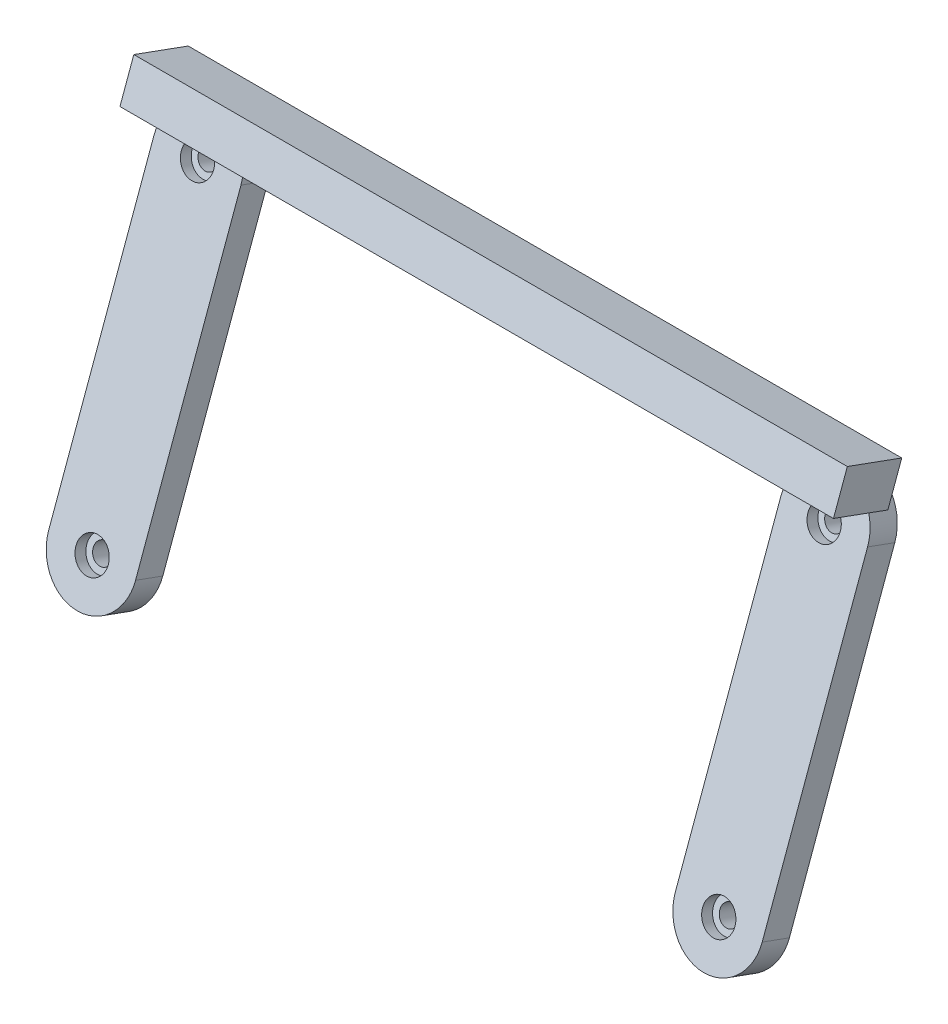
ISO-10303-21;
HEADER;
FILE_DESCRIPTION(('STEP AP214'),'2;1');
FILE_NAME('part.step','',(''),(''),'','','');
FILE_SCHEMA(('AUTOMOTIVE_DESIGN { 1 0 10303 214 1 1 1 1 }'));
ENDSEC;
DATA;
#1=APPLICATION_CONTEXT('core data for automotive mechanical design processes');
#2=APPLICATION_PROTOCOL_DEFINITION('international standard','automotive_design',2000,#1);
#3=PRODUCT_CONTEXT('',#1,'mechanical');
#4=PRODUCT('Part','Part','',(#3));
#5=PRODUCT_RELATED_PRODUCT_CATEGORY('part','',(#4));
#6=PRODUCT_DEFINITION_FORMATION('','',#4);
#7=PRODUCT_DEFINITION_CONTEXT('part definition',#1,'design');
#8=PRODUCT_DEFINITION('design','',#6,#7);
#9=PRODUCT_DEFINITION_SHAPE('','',#8);
#10=(LENGTH_UNIT() NAMED_UNIT(*) SI_UNIT(.MILLI.,.METRE.));
#11=(NAMED_UNIT(*) PLANE_ANGLE_UNIT() SI_UNIT($,.RADIAN.));
#12=(NAMED_UNIT(*) SI_UNIT($,.STERADIAN.) SOLID_ANGLE_UNIT());
#13=UNCERTAINTY_MEASURE_WITH_UNIT(LENGTH_MEASURE(1.E-05),#10,'distance_accuracy_value','');
#14=(GEOMETRIC_REPRESENTATION_CONTEXT(3) GLOBAL_UNCERTAINTY_ASSIGNED_CONTEXT((#13)) GLOBAL_UNIT_ASSIGNED_CONTEXT((#10,
#11,#12)) REPRESENTATION_CONTEXT('',''));
#15=CARTESIAN_POINT('',(0.,0.,0.));
#16=DIRECTION('',(0.,0.,1.));
#17=DIRECTION('',(1.,0.,0.));
#18=AXIS2_PLACEMENT_3D('',#15,#16,#17);
#19=CARTESIAN_POINT('',(54.1,32.8795650948428,-1.32540528538168));
#20=DIRECTION('',(0.,-0.939692620785908,0.342020143325669));
#21=DIRECTION('',(0.,-0.342020143325669,-0.939692620785908));
#22=AXIS2_PLACEMENT_3D('',#19,#20,#21);
#23=PLANE('',#22);
#24=DIRECTION('',(-1.,0.,0.));
#25=VECTOR('',#24,1.);
#26=CARTESIAN_POINT('',(54.1,29.4593636615861,-10.7223314932408));
#27=LINE('',#26,#25);
#28=CARTESIAN_POINT('',(48.2959066168327,29.4593636615861,-10.7223314932408));
#29=VERTEX_POINT('',#28);
#30=CARTESIAN_POINT('',(-48.2959066168326,29.4593636615861,-10.7223314932408));
#31=VERTEX_POINT('',#30);
#32=EDGE_CURVE('E63',#29,#31,#27,.T.);
#33=ORIENTED_EDGE('',*,*,#32,.F.);
#34=DIRECTION('',(0.,-0.342020143325669,-0.939692620785908));
#35=VECTOR('',#34,1.);
#36=CARTESIAN_POINT('',(48.2959066168327,30.1434039482374,-8.84294625166895));
#37=LINE('',#36,#35);
#38=CARTESIAN_POINT('',(48.2959066168327,30.1434039482374,-8.84294625166895));
#39=VERTEX_POINT('',#38);
#40=EDGE_CURVE('E56',#29,#39,#37,.F.);
#41=ORIENTED_EDGE('',*,*,#40,.T.);
#42=DIRECTION('',(-1.,0.,0.));
#43=VECTOR('',#42,1.);
#44=CARTESIAN_POINT('',(54.1,30.1434039482374,-8.84294625166895));
#45=LINE('',#44,#43);
#46=CARTESIAN_POINT('',(59.9040933831674,30.1434039482374,-8.84294625166895));
#47=VERTEX_POINT('',#46);
#48=EDGE_CURVE('E11',#47,#39,#45,.T.);
#49=ORIENTED_EDGE('',*,*,#48,.F.);
#50=DIRECTION('',(0.,-0.342020143325669,-0.939692620785908));
#51=VECTOR('',#50,1.);
#52=CARTESIAN_POINT('',(59.9040933831674,30.1434039482374,-8.84294625166895));
#53=LINE('',#52,#51);
#54=CARTESIAN_POINT('',(59.9040933831674,29.4593636615861,-10.7223314932408));
#55=VERTEX_POINT('',#54);
#56=EDGE_CURVE('E221',#47,#55,#53,.T.);
#57=ORIENTED_EDGE('',*,*,#56,.T.);
#58=CARTESIAN_POINT('',(61.6,29.4593636615861,-10.7223314932408));
#59=VERTEX_POINT('',#58);
#60=EDGE_CURVE('E242',#59,#55,#27,.T.);
#61=ORIENTED_EDGE('',*,*,#60,.F.);
#62=DIRECTION('',(0.,-0.342020143325669,-0.939692620785908));
#63=VECTOR('',#62,1.);
#64=CARTESIAN_POINT('',(61.6,32.8795650948428,-1.32540528538168));
#65=LINE('',#64,#63);
#66=CARTESIAN_POINT('',(61.6,32.8795650948428,-1.32540528538168));
#67=VERTEX_POINT('',#66);
#68=EDGE_CURVE('E253',#67,#59,#65,.T.);
#69=ORIENTED_EDGE('',*,*,#68,.F.);
#70=DIRECTION('',(-1.,0.,0.));
#71=VECTOR('',#70,1.);
#72=CARTESIAN_POINT('',(54.1,32.8795650948428,-1.32540528538168));
#73=LINE('',#72,#71);
#74=CARTESIAN_POINT('',(-61.6,32.8795650948428,-1.32540528538168));
#75=VERTEX_POINT('',#74);
#76=EDGE_CURVE('E228',#67,#75,#73,.T.);
#77=ORIENTED_EDGE('',*,*,#76,.T.);
#78=DIRECTION('',(0.,-0.342020143325669,-0.939692620785908));
#79=VECTOR('',#78,1.);
#80=CARTESIAN_POINT('',(-61.6,32.8795650948428,-1.32540528538168));
#81=LINE('',#80,#79);
#82=CARTESIAN_POINT('',(-61.6,29.4593636615861,-10.7223314932408));
#83=VERTEX_POINT('',#82);
#84=EDGE_CURVE('E241',#75,#83,#81,.T.);
#85=ORIENTED_EDGE('',*,*,#84,.T.);
#86=CARTESIAN_POINT('',(-59.9040933831673,29.4593636615861,-10.7223314932408));
#87=VERTEX_POINT('',#86);
#88=EDGE_CURVE('E227',#87,#83,#27,.T.);
#89=ORIENTED_EDGE('',*,*,#88,.F.);
#90=DIRECTION('',(0.,-0.342020143325669,-0.939692620785908));
#91=VECTOR('',#90,1.);
#92=CARTESIAN_POINT('',(-59.9040933831673,30.1434039482374,-8.84294625166895));
#93=LINE('',#92,#91);
#94=CARTESIAN_POINT('',(-59.9040933831673,30.1434039482374,-8.84294625166895));
#95=VERTEX_POINT('',#94);
#96=EDGE_CURVE('E327',#95,#87,#93,.T.);
#97=ORIENTED_EDGE('',*,*,#96,.F.);
#98=DIRECTION('',(1.,0.,0.));
#99=VECTOR('',#98,1.);
#100=CARTESIAN_POINT('',(-54.1,30.1434039482374,-8.84294625166895));
#101=LINE('',#100,#99);
#102=CARTESIAN_POINT('',(-48.2959066168326,30.1434039482374,-8.84294625166895));
#103=VERTEX_POINT('',#102);
#104=EDGE_CURVE('E255',#95,#103,#101,.T.);
#105=ORIENTED_EDGE('',*,*,#104,.T.);
#106=DIRECTION('',(0.,-0.342020143325669,-0.939692620785908));
#107=VECTOR('',#106,1.);
#108=CARTESIAN_POINT('',(-48.2959066168326,30.1434039482374,-8.84294625166895));
#109=LINE('',#108,#107);
#110=EDGE_CURVE('E324',#31,#103,#109,.F.);
#111=ORIENTED_EDGE('',*,*,#110,.F.);
#112=EDGE_LOOP('',(#33,#41,#49,#57,#61,#69,#77,#85,#89,#97,#105,#111));
#113=FACE_BOUND('',#112,.T.);
#114=ADVANCED_FACE('F41',(#113),#23,.T.);
#115=CARTESIAN_POINT('',(-54.1,25.6798639995565,-7.21835057089099));
#116=DIRECTION('',(0.,0.342020143325669,0.939692620785908));
#117=DIRECTION('',(0.,-0.939692620785908,0.342020143325669));
#118=AXIS2_PLACEMENT_3D('',#115,#116,#117);
#119=PLANE('',#118);
#120=ORIENTED_EDGE('',*,*,#104,.F.);
#121=CARTESIAN_POINT('',(-54.1,25.6798639995565,-7.21835057089099));
#122=DIRECTION('',(0.,0.342020143325669,0.939692620785908));
#123=DIRECTION('',(0.,-0.939692620785908,0.342020143325669));
#124=AXIS2_PLACEMENT_3D('',#121,#122,#123);
#125=CIRCLE('',#124,7.5);
#126=CARTESIAN_POINT('',(-61.6,25.6798639995565,-7.218350570891));
#127=VERTEX_POINT('',#126);
#128=EDGE_CURVE('E315',#95,#127,#125,.T.);
#129=ORIENTED_EDGE('',*,*,#128,.T.);
#130=DIRECTION('',(0.,0.939692620785908,-0.342020143325669));
#131=VECTOR('',#130,1.);
#132=CARTESIAN_POINT('',(-61.6,25.6798639995565,-7.218350570891));
#133=LINE('',#132,#131);
#134=CARTESIAN_POINT('',(-61.6,-24.3117834262538,10.9771210540346));
#135=VERTEX_POINT('',#134);
#136=EDGE_CURVE('E291',#135,#127,#133,.T.);
#137=ORIENTED_EDGE('',*,*,#136,.F.);
#138=CARTESIAN_POINT('',(-54.1,-24.3117834262538,10.9771210540346));
#139=DIRECTION('',(0.,0.342020143325669,0.939692620785908));
#140=DIRECTION('',(0.,-0.939692620785908,0.342020143325669));
#141=AXIS2_PLACEMENT_3D('',#138,#139,#140);
#142=CIRCLE('',#141,7.5);
#143=CARTESIAN_POINT('',(-46.6,-24.3117834262538,10.9771210540346));
#144=VERTEX_POINT('',#143);
#145=EDGE_CURVE('E270',#135,#144,#142,.T.);
#146=ORIENTED_EDGE('',*,*,#145,.T.);
#147=DIRECTION('',(0.,-0.939692620785908,0.342020143325669));
#148=VECTOR('',#147,1.);
#149=CARTESIAN_POINT('',(-46.6,-24.3117834262538,10.9771210540346));
#150=LINE('',#149,#148);
#151=CARTESIAN_POINT('',(-46.6,25.6798639995565,-7.218350570891));
#152=VERTEX_POINT('',#151);
#153=EDGE_CURVE('E287',#152,#144,#150,.T.);
#154=ORIENTED_EDGE('',*,*,#153,.F.);
#155=EDGE_CURVE('E318',#152,#103,#125,.T.);
#156=ORIENTED_EDGE('',*,*,#155,.T.);
#157=EDGE_LOOP('',(#120,#129,#137,#146,#154,#156));
#158=FACE_BOUND('',#157,.T.);
#159=CARTESIAN_POINT('',(-54.1,25.6798639995565,-7.21835057089099));
#160=DIRECTION('',(0.,0.342020143325669,0.939692620785908));
#161=DIRECTION('',(0.,-0.939692620785908,0.342020143325669));
#162=AXIS2_PLACEMENT_3D('',#159,#160,#161);
#163=CIRCLE('',#162,2.8);
#164=CARTESIAN_POINT('',(-54.1,23.048724661356,-6.26069416957912));
#165=VERTEX_POINT('',#164);
#166=EDGE_CURVE('E312',#165,#165,#163,.T.);
#167=ORIENTED_EDGE('',*,*,#166,.F.);
#168=EDGE_LOOP('',(#167));
#169=FACE_BOUND('',#168,.T.);
#170=CARTESIAN_POINT('',(-54.1,-24.3117834262538,10.9771210540346));
#171=DIRECTION('',(0.,0.342020143325669,0.939692620785908));
#172=DIRECTION('',(0.,-0.939692620785908,0.342020143325669));
#173=AXIS2_PLACEMENT_3D('',#170,#171,#172);
#174=CIRCLE('',#173,2.8);
#175=CARTESIAN_POINT('',(-54.1,-26.9429227644544,11.9347774553465));
#176=VERTEX_POINT('',#175);
#177=EDGE_CURVE('E275',#176,#176,#174,.T.);
#178=ORIENTED_EDGE('',*,*,#177,.F.);
#179=EDGE_LOOP('',(#178));
#180=FACE_BOUND('',#179,.T.);
#181=ADVANCED_FACE('F366',(#158,#169,#180),#119,.T.);
#182=CARTESIAN_POINT('',(-54.1,25.6798639995565,-7.21835057089099));
#183=DIRECTION('',(0.,-0.342020143325669,-0.939692620785908));
#184=DIRECTION('',(0.,0.939692620785908,-0.342020143325669));
#185=AXIS2_PLACEMENT_3D('',#182,#183,#184);
#186=CYLINDRICAL_SURFACE('',#185,7.5);
#187=ORIENTED_EDGE('',*,*,#128,.F.);
#188=ORIENTED_EDGE('',*,*,#96,.T.);
#189=CARTESIAN_POINT('',(-54.1,24.9958237129052,-9.09773581246281));
#190=DIRECTION('',(0.,-0.342020143325669,-0.939692620785908));
#191=DIRECTION('',(0.,0.939692620785908,-0.342020143325669));
#192=AXIS2_PLACEMENT_3D('',#189,#190,#191);
#193=CIRCLE('',#192,7.5);
#194=EDGE_CURVE('E321',#87,#31,#193,.T.);
#195=ORIENTED_EDGE('',*,*,#194,.T.);
#196=ORIENTED_EDGE('',*,*,#110,.T.);
#197=ORIENTED_EDGE('',*,*,#155,.F.);
#198=DIRECTION('',(0.,-0.342020143325669,-0.939692620785908));
#199=VECTOR('',#198,1.);
#200=CARTESIAN_POINT('',(-46.6,44.5847625129733,44.7224312118028));
#201=LINE('',#200,#199);
#202=CARTESIAN_POINT('',(-46.6,23.9697632829282,-11.9168136748205));
#203=VERTEX_POINT('',#202);
#204=EDGE_CURVE('E279',#152,#203,#201,.T.);
#205=ORIENTED_EDGE('',*,*,#204,.T.);
#206=CARTESIAN_POINT('',(-54.1,23.9697632829282,-11.9168136748205));
#207=DIRECTION('',(0.,-0.342020143325669,-0.939692620785908));
#208=DIRECTION('',(0.,0.939692620785908,-0.342020143325669));
#209=AXIS2_PLACEMENT_3D('',#206,#207,#208);
#210=CIRCLE('',#209,7.5);
#211=CARTESIAN_POINT('',(-61.6,23.9697632829282,-11.9168136748205));
#212=VERTEX_POINT('',#211);
#213=EDGE_CURVE('E301',#212,#203,#210,.T.);
#214=ORIENTED_EDGE('',*,*,#213,.F.);
#215=DIRECTION('',(0.,-0.342020143325669,-0.939692620785908));
#216=VECTOR('',#215,1.);
#217=CARTESIAN_POINT('',(-61.6,44.5847625129733,44.7224312118028));
#218=LINE('',#217,#216);
#219=EDGE_CURVE('E284',#127,#212,#218,.T.);
#220=ORIENTED_EDGE('',*,*,#219,.F.);
#221=EDGE_LOOP('',(#187,#188,#195,#196,#197,#205,#214,#220));
#222=FACE_BOUND('',#221,.T.);
#223=ADVANCED_FACE('F43',(#222),#186,.T.);
#224=CARTESIAN_POINT('',(-54.1,25.6798639995565,-7.21835057089099));
#225=DIRECTION('',(0.,-0.342020143325669,-0.939692620785908));
#226=DIRECTION('',(0.,0.939692620785908,-0.342020143325669));
#227=AXIS2_PLACEMENT_3D('',#224,#225,#226);
#228=CYLINDRICAL_SURFACE('',#227,2.8);
#229=ORIENTED_EDGE('',*,*,#166,.T.);
#230=EDGE_LOOP('',(#229));
#231=FACE_BOUND('',#230,.T.);
#232=CARTESIAN_POINT('',(-54.1,24.9958237129052,-9.09773581246281));
#233=DIRECTION('',(0.,0.342020143325669,0.939692620785908));
#234=DIRECTION('',(0.,-0.939692620785908,0.342020143325669));
#235=AXIS2_PLACEMENT_3D('',#232,#233,#234);
#236=CIRCLE('',#235,2.8);
#237=CARTESIAN_POINT('',(-54.1,22.3646843747046,-8.14007941115094));
#238=VERTEX_POINT('',#237);
#239=EDGE_CURVE('E309',#238,#238,#236,.T.);
#240=ORIENTED_EDGE('',*,*,#239,.F.);
#241=EDGE_LOOP('',(#240));
#242=FACE_BOUND('',#241,.T.);
#243=ADVANCED_FACE('F404',(#231,#242),#228,.F.);
#244=CARTESIAN_POINT('',(-54.1,24.9958237129052,-9.09773581246281));
#245=DIRECTION('',(0.,-0.342020143325669,-0.939692620785908));
#246=DIRECTION('',(0.,0.939692620785908,-0.342020143325669));
#247=AXIS2_PLACEMENT_3D('',#244,#245,#246);
#248=PLANE('',#247);
#249=CARTESIAN_POINT('',(-54.1,24.9958237129052,-9.09773581246281));
#250=DIRECTION('',(0.,-0.342020143325669,-0.939692620785908));
#251=DIRECTION('',(0.,0.939692620785908,-0.342020143325669));
#252=AXIS2_PLACEMENT_3D('',#249,#250,#251);
#253=CIRCLE('',#252,1.7);
#254=CARTESIAN_POINT('',(-54.1,26.5933011682412,-9.67917005611645));
#255=VERTEX_POINT('',#254);
#256=EDGE_CURVE('E306',#255,#255,#253,.T.);
#257=ORIENTED_EDGE('',*,*,#256,.T.);
#258=EDGE_LOOP('',(#257));
#259=FACE_BOUND('',#258,.T.);
#260=ORIENTED_EDGE('',*,*,#239,.T.);
#261=EDGE_LOOP('',(#260));
#262=FACE_BOUND('',#261,.T.);
#263=ADVANCED_FACE('F400',(#259,#262),#248,.F.);
#264=CARTESIAN_POINT('',(-54.1,23.9697632829282,-11.9168136748205));
#265=DIRECTION('',(0.,-0.342020143325669,-0.939692620785908));
#266=DIRECTION('',(0.,0.939692620785908,-0.342020143325669));
#267=AXIS2_PLACEMENT_3D('',#264,#265,#266);
#268=PLANE('',#267);
#269=ORIENTED_EDGE('',*,*,#213,.T.);
#270=DIRECTION('',(0.,-0.939692620785908,0.342020143325669));
#271=VECTOR('',#270,1.);
#272=CARTESIAN_POINT('',(-46.6,-26.0218841428822,6.27865795010509));
#273=LINE('',#272,#271);
#274=CARTESIAN_POINT('',(-46.6,-26.0218841428822,6.27865795010509));
#275=VERTEX_POINT('',#274);
#276=EDGE_CURVE('E298',#203,#275,#273,.T.);
#277=ORIENTED_EDGE('',*,*,#276,.T.);
#278=CARTESIAN_POINT('',(-54.1,-26.0218841428822,6.27865795010509));
#279=DIRECTION('',(0.,-0.342020143325669,-0.939692620785908));
#280=DIRECTION('',(0.,0.939692620785908,-0.342020143325669));
#281=AXIS2_PLACEMENT_3D('',#278,#279,#280);
#282=CIRCLE('',#281,7.50000000000001);
#283=CARTESIAN_POINT('',(-61.6,-26.0218841428822,6.27865795010509));
#284=VERTEX_POINT('',#283);
#285=EDGE_CURVE('E263',#275,#284,#282,.T.);
#286=ORIENTED_EDGE('',*,*,#285,.T.);
#287=DIRECTION('',(0.,0.939692620785908,-0.342020143325669));
#288=VECTOR('',#287,1.);
#289=CARTESIAN_POINT('',(-61.6,23.9697632829282,-11.9168136748205));
#290=LINE('',#289,#288);
#291=EDGE_CURVE('E297',#284,#212,#290,.T.);
#292=ORIENTED_EDGE('',*,*,#291,.T.);
#293=EDGE_LOOP('',(#269,#277,#286,#292));
#294=FACE_BOUND('',#293,.T.);
#295=CARTESIAN_POINT('',(-54.1,23.9697632829282,-11.9168136748205));
#296=DIRECTION('',(0.,-0.342020143325669,-0.939692620785908));
#297=DIRECTION('',(0.,0.939692620785908,-0.342020143325669));
#298=AXIS2_PLACEMENT_3D('',#295,#296,#297);
#299=CIRCLE('',#298,1.7);
#300=CARTESIAN_POINT('',(-54.1,25.5672407382642,-12.4982479184742));
#301=VERTEX_POINT('',#300);
#302=EDGE_CURVE('E305',#301,#301,#299,.T.);
#303=ORIENTED_EDGE('',*,*,#302,.F.);
#304=EDGE_LOOP('',(#303));
#305=FACE_BOUND('',#304,.T.);
#306=CARTESIAN_POINT('',(-54.1,-26.0218841428822,6.27865795010509));
#307=DIRECTION('',(0.,-0.342020143325669,-0.939692620785908));
#308=DIRECTION('',(0.,0.939692620785908,-0.342020143325669));
#309=AXIS2_PLACEMENT_3D('',#306,#307,#308);
#310=CIRCLE('',#309,1.7);
#311=CARTESIAN_POINT('',(-54.1,-24.4244066875461,5.69722370645145));
#312=VERTEX_POINT('',#311);
#313=EDGE_CURVE('E266',#312,#312,#310,.T.);
#314=ORIENTED_EDGE('',*,*,#313,.F.);
#315=EDGE_LOOP('',(#314));
#316=FACE_BOUND('',#315,.T.);
#317=ADVANCED_FACE('F403',(#294,#305,#316),#268,.T.);
#318=CARTESIAN_POINT('',(-54.1,23.9697632829282,-11.9168136748205));
#319=DIRECTION('',(0.,0.342020143325669,0.939692620785908));
#320=DIRECTION('',(0.,-0.939692620785908,0.342020143325669));
#321=AXIS2_PLACEMENT_3D('',#318,#319,#320);
#322=CYLINDRICAL_SURFACE('',#321,1.7);
#323=ORIENTED_EDGE('',*,*,#302,.T.);
#324=EDGE_LOOP('',(#323));
#325=FACE_BOUND('',#324,.T.);
#326=ORIENTED_EDGE('',*,*,#256,.F.);
#327=EDGE_LOOP('',(#326));
#328=FACE_BOUND('',#327,.T.);
#329=ADVANCED_FACE('F395',(#325,#328),#322,.F.);
#330=CARTESIAN_POINT('',(-46.6,-5.40688491283703,62.9179028367284));
#331=DIRECTION('',(1.,0.,0.));
#332=DIRECTION('',(0.,0.,-1.));
#333=AXIS2_PLACEMENT_3D('',#330,#331,#332);
#334=PLANE('',#333);
#335=ORIENTED_EDGE('',*,*,#204,.F.);
#336=ORIENTED_EDGE('',*,*,#153,.T.);
#337=DIRECTION('',(0.,-0.342020143325669,-0.939692620785908));
#338=VECTOR('',#337,1.);
#339=CARTESIAN_POINT('',(-46.6,-5.40688491283703,62.9179028367284));
#340=LINE('',#339,#338);
#341=EDGE_CURVE('E285',#144,#275,#340,.T.);
#342=ORIENTED_EDGE('',*,*,#341,.T.);
#343=ORIENTED_EDGE('',*,*,#276,.F.);
#344=EDGE_LOOP('',(#335,#336,#342,#343));
#345=FACE_BOUND('',#344,.T.);
#346=ADVANCED_FACE('F392',(#345),#334,.T.);
#347=CARTESIAN_POINT('',(-61.6,44.5847625129733,44.7224312118028));
#348=DIRECTION('',(-1.,0.,0.));
#349=DIRECTION('',(0.,0.,1.));
#350=AXIS2_PLACEMENT_3D('',#347,#348,#349);
#351=PLANE('',#350);
#352=DIRECTION('',(0.,-0.342020143325669,-0.939692620785908));
#353=VECTOR('',#352,1.);
#354=CARTESIAN_POINT('',(-61.6,-5.40688491283703,62.9179028367284));
#355=LINE('',#354,#353);
#356=EDGE_CURVE('E288',#135,#284,#355,.T.);
#357=ORIENTED_EDGE('',*,*,#356,.F.);
#358=ORIENTED_EDGE('',*,*,#136,.T.);
#359=ORIENTED_EDGE('',*,*,#219,.T.);
#360=ORIENTED_EDGE('',*,*,#291,.F.);
#361=EDGE_LOOP('',(#357,#358,#359,#360));
#362=FACE_BOUND('',#361,.T.);
#363=ADVANCED_FACE('F387',(#362),#351,.T.);
#364=CARTESIAN_POINT('',(-54.1,-24.3117834262538,10.9771210540346));
#365=DIRECTION('',(0.,-0.342020143325669,-0.939692620785908));
#366=DIRECTION('',(0.,0.939692620785908,-0.342020143325669));
#367=AXIS2_PLACEMENT_3D('',#364,#365,#366);
#368=CYLINDRICAL_SURFACE('',#367,7.5);
#369=ORIENTED_EDGE('',*,*,#285,.F.);
#370=ORIENTED_EDGE('',*,*,#341,.F.);
#371=ORIENTED_EDGE('',*,*,#145,.F.);
#372=ORIENTED_EDGE('',*,*,#356,.T.);
#373=EDGE_LOOP('',(#369,#370,#371,#372));
#374=FACE_BOUND('',#373,.T.);
#375=ADVANCED_FACE('F384',(#374),#368,.T.);
#376=CARTESIAN_POINT('',(-54.1,-24.3117834262538,10.9771210540346));
#377=DIRECTION('',(0.,-0.342020143325669,-0.939692620785908));
#378=DIRECTION('',(0.,0.939692620785908,-0.342020143325669));
#379=AXIS2_PLACEMENT_3D('',#376,#377,#378);
#380=CYLINDRICAL_SURFACE('',#379,2.8);
#381=ORIENTED_EDGE('',*,*,#177,.T.);
#382=EDGE_LOOP('',(#381));
#383=FACE_BOUND('',#382,.T.);
#384=CARTESIAN_POINT('',(-54.1,-24.9958237129052,9.09773581246281));
#385=DIRECTION('',(0.,0.342020143325669,0.939692620785908));
#386=DIRECTION('',(0.,-0.939692620785908,0.342020143325669));
#387=AXIS2_PLACEMENT_3D('',#384,#385,#386);
#388=CIRCLE('',#387,2.8);
#389=CARTESIAN_POINT('',(-54.1,-27.6269630511057,10.0553922137747));
#390=VERTEX_POINT('',#389);
#391=EDGE_CURVE('E276',#390,#390,#388,.T.);
#392=ORIENTED_EDGE('',*,*,#391,.F.);
#393=EDGE_LOOP('',(#392));
#394=FACE_BOUND('',#393,.T.);
#395=ADVANCED_FACE('F380',(#383,#394),#380,.F.);
#396=CARTESIAN_POINT('',(-54.1,-24.9958237129052,9.09773581246281));
#397=DIRECTION('',(0.,-0.342020143325669,-0.939692620785908));
#398=DIRECTION('',(0.,0.939692620785908,-0.342020143325669));
#399=AXIS2_PLACEMENT_3D('',#396,#397,#398);
#400=PLANE('',#399);
#401=CARTESIAN_POINT('',(-54.1,-24.9958237129052,9.09773581246281));
#402=DIRECTION('',(0.,-0.342020143325669,-0.939692620785908));
#403=DIRECTION('',(0.,0.939692620785908,-0.342020143325669));
#404=AXIS2_PLACEMENT_3D('',#401,#402,#403);
#405=CIRCLE('',#404,1.7);
#406=CARTESIAN_POINT('',(-54.1,-23.3983462575691,8.51630156880917));
#407=VERTEX_POINT('',#406);
#408=EDGE_CURVE('E267',#407,#407,#405,.T.);
#409=ORIENTED_EDGE('',*,*,#408,.T.);
#410=EDGE_LOOP('',(#409));
#411=FACE_BOUND('',#410,.T.);
#412=ORIENTED_EDGE('',*,*,#391,.T.);
#413=EDGE_LOOP('',(#412));
#414=FACE_BOUND('',#413,.T.);
#415=ADVANCED_FACE('F376',(#411,#414),#400,.F.);
#416=CARTESIAN_POINT('',(-54.1,-26.0218841428822,6.27865795010509));
#417=DIRECTION('',(0.,0.342020143325669,0.939692620785908));
#418=DIRECTION('',(0.,-0.939692620785908,0.342020143325669));
#419=AXIS2_PLACEMENT_3D('',#416,#417,#418);
#420=CYLINDRICAL_SURFACE('',#419,1.7);
#421=ORIENTED_EDGE('',*,*,#313,.T.);
#422=EDGE_LOOP('',(#421));
#423=FACE_BOUND('',#422,.T.);
#424=ORIENTED_EDGE('',*,*,#408,.F.);
#425=EDGE_LOOP('',(#424));
#426=FACE_BOUND('',#425,.T.);
#427=ADVANCED_FACE('F379',(#423,#426),#420,.F.);
#428=CARTESIAN_POINT('',(61.6,28.4160251461618,0.299190395396278));
#429=DIRECTION('',(1.,0.,0.));
#430=DIRECTION('',(0.,1.,0.));
#431=AXIS2_PLACEMENT_3D('',#428,#429,#430);
#432=PLANE('',#431);
#433=DIRECTION('',(0.,-0.939692620785908,0.342020143325669));
#434=VECTOR('',#433,1.);
#435=CARTESIAN_POINT('',(61.6,24.9958237129051,-9.0977358124628));
#436=LINE('',#435,#434);
#437=CARTESIAN_POINT('',(61.6,36.0372120070922,-13.1164724965222));
#438=VERTEX_POINT('',#437);
#439=EDGE_CURVE('E232',#438,#59,#436,.T.);
#440=ORIENTED_EDGE('',*,*,#439,.F.);
#441=DIRECTION('',(0.,-0.342020143325669,-0.939692620785908));
#442=VECTOR('',#441,1.);
#443=CARTESIAN_POINT('',(61.6,39.4574134403488,-3.71954628866308));
#444=LINE('',#443,#442);
#445=CARTESIAN_POINT('',(61.6,39.4574134403488,-3.71954628866308));
#446=VERTEX_POINT('',#445);
#447=EDGE_CURVE('E256',#446,#438,#444,.T.);
#448=ORIENTED_EDGE('',*,*,#447,.F.);
#449=DIRECTION('',(0.,-0.939692620785908,0.342020143325669));
#450=VECTOR('',#449,1.);
#451=CARTESIAN_POINT('',(61.6,28.4160251461618,0.299190395396278));
#452=LINE('',#451,#450);
#453=EDGE_CURVE('E238',#446,#67,#452,.T.);
#454=ORIENTED_EDGE('',*,*,#453,.T.);
#455=ORIENTED_EDGE('',*,*,#68,.T.);
#456=EDGE_LOOP('',(#440,#448,#454,#455));
#457=FACE_BOUND('',#456,.T.);
#458=ADVANCED_FACE('F345',(#457),#432,.T.);
#459=CARTESIAN_POINT('',(54.1,39.4574134403488,-3.71954628866308));
#460=DIRECTION('',(0.,0.939692620785908,-0.342020143325669));
#461=DIRECTION('',(0.,0.342020143325669,0.939692620785908));
#462=AXIS2_PLACEMENT_3D('',#459,#460,#461);
#463=PLANE('',#462);
#464=DIRECTION('',(1.,0.,0.));
#465=VECTOR('',#464,1.);
#466=CARTESIAN_POINT('',(54.1,36.0372120070921,-13.1164724965222));
#467=LINE('',#466,#465);
#468=CARTESIAN_POINT('',(-61.6000000000001,36.0372120070921,-13.1164724965222));
#469=VERTEX_POINT('',#468);
#470=EDGE_CURVE('E248',#469,#438,#467,.T.);
#471=ORIENTED_EDGE('',*,*,#470,.F.);
#472=DIRECTION('',(0.,-0.342020143325669,-0.939692620785908));
#473=VECTOR('',#472,1.);
#474=CARTESIAN_POINT('',(-61.6000000000001,39.4574134403488,-3.71954628866308));
#475=LINE('',#474,#473);
#476=CARTESIAN_POINT('',(-61.6000000000001,39.4574134403488,-3.71954628866308));
#477=VERTEX_POINT('',#476);
#478=EDGE_CURVE('E258',#477,#469,#475,.T.);
#479=ORIENTED_EDGE('',*,*,#478,.F.);
#480=DIRECTION('',(1.,0.,0.));
#481=VECTOR('',#480,1.);
#482=CARTESIAN_POINT('',(54.1,39.4574134403488,-3.71954628866308));
#483=LINE('',#482,#481);
#484=EDGE_CURVE('E235',#477,#446,#483,.T.);
#485=ORIENTED_EDGE('',*,*,#484,.T.);
#486=ORIENTED_EDGE('',*,*,#447,.T.);
#487=EDGE_LOOP('',(#471,#479,#485,#486));
#488=FACE_BOUND('',#487,.T.);
#489=ADVANCED_FACE('F342',(#488),#463,.T.);
#490=CARTESIAN_POINT('',(-61.6,28.4160251461618,0.299190395396312));
#491=DIRECTION('',(-1.,0.,0.));
#492=DIRECTION('',(0.,-1.,0.));
#493=AXIS2_PLACEMENT_3D('',#490,#491,#492);
#494=PLANE('',#493);
#495=DIRECTION('',(0.,0.939692620785908,-0.342020143325669));
#496=VECTOR('',#495,1.);
#497=CARTESIAN_POINT('',(-61.6,24.9958237129051,-9.09773581246277));
#498=LINE('',#497,#496);
#499=EDGE_CURVE('E245',#83,#469,#498,.T.);
#500=ORIENTED_EDGE('',*,*,#499,.F.);
#501=ORIENTED_EDGE('',*,*,#84,.F.);
#502=DIRECTION('',(0.,0.939692620785908,-0.342020143325669));
#503=VECTOR('',#502,1.);
#504=CARTESIAN_POINT('',(-61.6,28.4160251461618,0.299190395396312));
#505=LINE('',#504,#503);
#506=EDGE_CURVE('E231',#75,#477,#505,.T.);
#507=ORIENTED_EDGE('',*,*,#506,.T.);
#508=ORIENTED_EDGE('',*,*,#478,.T.);
#509=EDGE_LOOP('',(#500,#501,#507,#508));
#510=FACE_BOUND('',#509,.T.);
#511=ADVANCED_FACE('F338',(#510),#494,.T.);
#512=CARTESIAN_POINT('',(0.,3.42020143325669,9.39692620785908));
#513=DIRECTION('',(0.,-0.342020143325669,-0.939692620785908));
#514=DIRECTION('',(0.,0.939692620785908,-0.342020143325669));
#515=AXIS2_PLACEMENT_3D('',#512,#513,#514);
#516=PLANE('',#515);
#517=ORIENTED_EDGE('',*,*,#76,.F.);
#518=ORIENTED_EDGE('',*,*,#453,.F.);
#519=ORIENTED_EDGE('',*,*,#484,.F.);
#520=ORIENTED_EDGE('',*,*,#506,.F.);
#521=EDGE_LOOP('',(#517,#518,#519,#520));
#522=FACE_BOUND('',#521,.T.);
#523=ADVANCED_FACE('F471',(#522),#516,.F.);
#524=CARTESIAN_POINT('',(0.,0.,0.));
#525=DIRECTION('',(0.,-0.342020143325669,-0.939692620785908));
#526=DIRECTION('',(0.,0.939692620785908,-0.342020143325669));
#527=AXIS2_PLACEMENT_3D('',#524,#525,#526);
#528=PLANE('',#527);
#529=ORIENTED_EDGE('',*,*,#60,.T.);
#530=CARTESIAN_POINT('',(54.1,24.9958237129052,-9.09773581246281));
#531=DIRECTION('',(0.,-0.342020143325669,-0.939692620785908));
#532=DIRECTION('',(0.,0.939692620785908,-0.342020143325669));
#533=AXIS2_PLACEMENT_3D('',#530,#531,#532);
#534=CIRCLE('',#533,7.5);
#535=EDGE_CURVE('E49',#55,#29,#534,.F.);
#536=ORIENTED_EDGE('',*,*,#535,.T.);
#537=ORIENTED_EDGE('',*,*,#32,.T.);
#538=ORIENTED_EDGE('',*,*,#194,.F.);
#539=ORIENTED_EDGE('',*,*,#88,.T.);
#540=ORIENTED_EDGE('',*,*,#499,.T.);
#541=ORIENTED_EDGE('',*,*,#470,.T.);
#542=ORIENTED_EDGE('',*,*,#439,.T.);
#543=EDGE_LOOP('',(#529,#536,#537,#538,#539,#540,#541,#542));
#544=FACE_BOUND('',#543,.T.);
#545=ADVANCED_FACE('F329',(#544),#528,.T.);
#546=CARTESIAN_POINT('',(54.1,25.6798639995565,-7.21835057089099));
#547=DIRECTION('',(0.,0.342020143325669,0.939692620785908));
#548=DIRECTION('',(0.,-0.939692620785908,0.342020143325669));
#549=AXIS2_PLACEMENT_3D('',#546,#547,#548);
#550=PLANE('',#549);
#551=CARTESIAN_POINT('',(54.1,25.6798639995565,-7.21835057089099));
#552=DIRECTION('',(0.,0.342020143325669,0.939692620785908));
#553=DIRECTION('',(0.,-0.939692620785908,0.342020143325669));
#554=AXIS2_PLACEMENT_3D('',#551,#552,#553);
#555=CIRCLE('',#554,7.5);
#556=CARTESIAN_POINT('',(61.6,25.6798639995565,-7.218350570891));
#557=VERTEX_POINT('',#556);
#558=EDGE_CURVE('E214',#557,#47,#555,.T.);
#559=ORIENTED_EDGE('',*,*,#558,.T.);
#560=ORIENTED_EDGE('',*,*,#48,.T.);
#561=CARTESIAN_POINT('',(46.6,25.6798639995565,-7.218350570891));
#562=VERTEX_POINT('',#561);
#563=EDGE_CURVE('E213',#39,#562,#555,.T.);
#564=ORIENTED_EDGE('',*,*,#563,.T.);
#565=DIRECTION('',(0.,0.939692620785908,-0.342020143325669));
#566=VECTOR('',#565,1.);
#567=CARTESIAN_POINT('',(46.6,-24.3117834262538,10.9771210540346));
#568=LINE('',#567,#566);
#569=CARTESIAN_POINT('',(46.6,-24.3117834262538,10.9771210540346));
#570=VERTEX_POINT('',#569);
#571=EDGE_CURVE('E176',#570,#562,#568,.T.);
#572=ORIENTED_EDGE('',*,*,#571,.F.);
#573=CARTESIAN_POINT('',(54.1,-24.3117834262538,10.9771210540346));
#574=DIRECTION('',(0.,0.342020143325669,0.939692620785908));
#575=DIRECTION('',(0.,-0.939692620785908,0.342020143325669));
#576=AXIS2_PLACEMENT_3D('',#573,#574,#575);
#577=CIRCLE('',#576,7.5);
#578=CARTESIAN_POINT('',(61.6,-24.3117834262538,10.9771210540346));
#579=VERTEX_POINT('',#578);
#580=EDGE_CURVE('E175',#570,#579,#577,.T.);
#581=ORIENTED_EDGE('',*,*,#580,.T.);
#582=DIRECTION('',(0.,-0.939692620785908,0.342020143325669));
#583=VECTOR('',#582,1.);
#584=CARTESIAN_POINT('',(61.6,25.6798639995565,-7.218350570891));
#585=LINE('',#584,#583);
#586=EDGE_CURVE('E166',#557,#579,#585,.T.);
#587=ORIENTED_EDGE('',*,*,#586,.F.);
#588=EDGE_LOOP('',(#559,#560,#564,#572,#581,#587));
#589=FACE_BOUND('',#588,.T.);
#590=CARTESIAN_POINT('',(54.1,25.6798639995565,-7.21835057089099));
#591=DIRECTION('',(0.,0.342020143325669,0.939692620785908));
#592=DIRECTION('',(0.,-0.939692620785908,0.342020143325669));
#593=AXIS2_PLACEMENT_3D('',#590,#591,#592);
#594=CIRCLE('',#593,2.8);
#595=CARTESIAN_POINT('',(54.1,23.048724661356,-6.26069416957912));
#596=VERTEX_POINT('',#595);
#597=EDGE_CURVE('E217',#596,#596,#594,.T.);
#598=ORIENTED_EDGE('',*,*,#597,.F.);
#599=EDGE_LOOP('',(#598));
#600=FACE_BOUND('',#599,.T.);
#601=CARTESIAN_POINT('',(54.1,-24.3117834262538,10.9771210540346));
#602=DIRECTION('',(0.,0.342020143325669,0.939692620785908));
#603=DIRECTION('',(0.,-0.939692620785908,0.342020143325669));
#604=AXIS2_PLACEMENT_3D('',#601,#602,#603);
#605=CIRCLE('',#604,2.8);
#606=CARTESIAN_POINT('',(54.1,-26.9429227644544,11.9347774553465));
#607=VERTEX_POINT('',#606);
#608=EDGE_CURVE('E191',#607,#607,#605,.T.);
#609=ORIENTED_EDGE('',*,*,#608,.F.);
#610=EDGE_LOOP('',(#609));
#611=FACE_BOUND('',#610,.T.);
#612=ADVANCED_FACE('F350',(#589,#600,#611),#550,.T.);
#613=CARTESIAN_POINT('',(54.1,25.6798639995565,-7.21835057089099));
#614=DIRECTION('',(0.,-0.342020143325669,-0.939692620785908));
#615=DIRECTION('',(0.,0.939692620785908,-0.342020143325669));
#616=AXIS2_PLACEMENT_3D('',#613,#614,#615);
#617=CYLINDRICAL_SURFACE('',#616,7.5);
#618=ORIENTED_EDGE('',*,*,#40,.F.);
#619=ORIENTED_EDGE('',*,*,#535,.F.);
#620=ORIENTED_EDGE('',*,*,#56,.F.);
#621=ORIENTED_EDGE('',*,*,#558,.F.);
#622=DIRECTION('',(0.,-0.342020143325669,-0.939692620785908));
#623=VECTOR('',#622,1.);
#624=CARTESIAN_POINT('',(61.6,44.5847625129733,44.7224312118028));
#625=LINE('',#624,#623);
#626=CARTESIAN_POINT('',(61.6,23.9697632829282,-11.9168136748205));
#627=VERTEX_POINT('',#626);
#628=EDGE_CURVE('E200',#557,#627,#625,.T.);
#629=ORIENTED_EDGE('',*,*,#628,.T.);
#630=CARTESIAN_POINT('',(54.1,23.9697632829282,-11.9168136748205));
#631=DIRECTION('',(0.,-0.342020143325669,-0.939692620785908));
#632=DIRECTION('',(0.,0.939692620785908,-0.342020143325669));
#633=AXIS2_PLACEMENT_3D('',#630,#631,#632);
#634=CIRCLE('',#633,7.50000000000001);
#635=CARTESIAN_POINT('',(46.6,23.9697632829282,-11.9168136748205));
#636=VERTEX_POINT('',#635);
#637=EDGE_CURVE('E209',#636,#627,#634,.T.);
#638=ORIENTED_EDGE('',*,*,#637,.F.);
#639=DIRECTION('',(0.,-0.342020143325669,-0.939692620785908));
#640=VECTOR('',#639,1.);
#641=CARTESIAN_POINT('',(46.6,44.5847625129733,44.7224312118028));
#642=LINE('',#641,#640);
#643=EDGE_CURVE('E161',#562,#636,#642,.T.);
#644=ORIENTED_EDGE('',*,*,#643,.F.);
#645=ORIENTED_EDGE('',*,*,#563,.F.);
#646=EDGE_LOOP('',(#618,#619,#620,#621,#629,#638,#644,#645));
#647=FACE_BOUND('',#646,.T.);
#648=ADVANCED_FACE('F348',(#647),#617,.T.);
#649=CARTESIAN_POINT('',(54.1,25.6798639995565,-7.21835057089099));
#650=DIRECTION('',(0.,-0.342020143325669,-0.939692620785908));
#651=DIRECTION('',(0.,0.939692620785908,-0.342020143325669));
#652=AXIS2_PLACEMENT_3D('',#649,#650,#651);
#653=CYLINDRICAL_SURFACE('',#652,2.8);
#654=ORIENTED_EDGE('',*,*,#597,.T.);
#655=EDGE_LOOP('',(#654));
#656=FACE_BOUND('',#655,.T.);
#657=CARTESIAN_POINT('',(54.1,24.9958237129052,-9.09773581246281));
#658=DIRECTION('',(0.,0.342020143325669,0.939692620785908));
#659=DIRECTION('',(0.,-0.939692620785908,0.342020143325669));
#660=AXIS2_PLACEMENT_3D('',#657,#658,#659);
#661=CIRCLE('',#660,2.8);
#662=CARTESIAN_POINT('',(54.1,22.3646843747046,-8.14007941115094));
#663=VERTEX_POINT('',#662);
#664=EDGE_CURVE('E218',#663,#663,#661,.T.);
#665=ORIENTED_EDGE('',*,*,#664,.F.);
#666=EDGE_LOOP('',(#665));
#667=FACE_BOUND('',#666,.T.);
#668=ADVANCED_FACE('F500',(#656,#667),#653,.F.);
#669=CARTESIAN_POINT('',(54.1,24.9958237129052,-9.09773581246281));
#670=DIRECTION('',(0.,-0.342020143325669,-0.939692620785908));
#671=DIRECTION('',(0.,0.939692620785908,-0.342020143325669));
#672=AXIS2_PLACEMENT_3D('',#669,#670,#671);
#673=PLANE('',#672);
#674=CARTESIAN_POINT('',(54.1,24.9958237129052,-9.09773581246281));
#675=DIRECTION('',(0.,-0.342020143325669,-0.939692620785908));
#676=DIRECTION('',(0.,0.939692620785908,-0.342020143325669));
#677=AXIS2_PLACEMENT_3D('',#674,#675,#676);
#678=CIRCLE('',#677,1.7);
#679=CARTESIAN_POINT('',(54.1,26.5933011682412,-9.67917005611645));
#680=VERTEX_POINT('',#679);
#681=EDGE_CURVE('E205',#680,#680,#678,.T.);
#682=ORIENTED_EDGE('',*,*,#681,.T.);
#683=EDGE_LOOP('',(#682));
#684=FACE_BOUND('',#683,.T.);
#685=ORIENTED_EDGE('',*,*,#664,.T.);
#686=EDGE_LOOP('',(#685));
#687=FACE_BOUND('',#686,.T.);
#688=ADVANCED_FACE('F507',(#684,#687),#673,.F.);
#689=CARTESIAN_POINT('',(54.1,23.9697632829282,-11.9168136748205));
#690=DIRECTION('',(0.,-0.342020143325669,-0.939692620785908));
#691=DIRECTION('',(0.,0.939692620785908,-0.342020143325669));
#692=AXIS2_PLACEMENT_3D('',#689,#690,#691);
#693=PLANE('',#692);
#694=ORIENTED_EDGE('',*,*,#637,.T.);
#695=DIRECTION('',(0.,-0.939692620785908,0.342020143325669));
#696=VECTOR('',#695,1.);
#697=CARTESIAN_POINT('',(61.6,23.9697632829282,-11.9168136748205));
#698=LINE('',#697,#696);
#699=CARTESIAN_POINT('',(61.6,-26.0218841428822,6.27865795010509));
#700=VERTEX_POINT('',#699);
#701=EDGE_CURVE('E167',#627,#700,#698,.T.);
#702=ORIENTED_EDGE('',*,*,#701,.T.);
#703=CARTESIAN_POINT('',(54.1,-26.0218841428822,6.27865795010509));
#704=DIRECTION('',(0.,-0.342020143325669,-0.939692620785908));
#705=DIRECTION('',(0.,0.939692620785908,-0.342020143325669));
#706=AXIS2_PLACEMENT_3D('',#703,#704,#705);
#707=CIRCLE('',#706,7.5);
#708=CARTESIAN_POINT('',(46.6,-26.0218841428822,6.27865795010509));
#709=VERTEX_POINT('',#708);
#710=EDGE_CURVE('E173',#700,#709,#707,.T.);
#711=ORIENTED_EDGE('',*,*,#710,.T.);
#712=DIRECTION('',(0.,0.939692620785908,-0.342020143325669));
#713=VECTOR('',#712,1.);
#714=CARTESIAN_POINT('',(46.6,-26.0218841428822,6.27865795010509));
#715=LINE('',#714,#713);
#716=EDGE_CURVE('E154',#709,#636,#715,.T.);
#717=ORIENTED_EDGE('',*,*,#716,.T.);
#718=EDGE_LOOP('',(#694,#702,#711,#717));
#719=FACE_BOUND('',#718,.T.);
#720=CARTESIAN_POINT('',(54.1,23.9697632829282,-11.9168136748205));
#721=DIRECTION('',(0.,-0.342020143325669,-0.939692620785908));
#722=DIRECTION('',(0.,0.939692620785908,-0.342020143325669));
#723=AXIS2_PLACEMENT_3D('',#720,#721,#722);
#724=CIRCLE('',#723,1.7);
#725=CARTESIAN_POINT('',(54.1,25.5672407382642,-12.4982479184742));
#726=VERTEX_POINT('',#725);
#727=EDGE_CURVE('E206',#726,#726,#724,.T.);
#728=ORIENTED_EDGE('',*,*,#727,.F.);
#729=EDGE_LOOP('',(#728));
#730=FACE_BOUND('',#729,.T.);
#731=CARTESIAN_POINT('',(54.1,-26.0218841428822,6.27865795010509));
#732=DIRECTION('',(0.,-0.342020143325669,-0.939692620785908));
#733=DIRECTION('',(0.,0.939692620785908,-0.342020143325669));
#734=AXIS2_PLACEMENT_3D('',#731,#732,#733);
#735=CIRCLE('',#734,1.7);
#736=CARTESIAN_POINT('',(54.1,-24.4244066875461,5.69722370645145));
#737=VERTEX_POINT('',#736);
#738=EDGE_CURVE('E182',#737,#737,#735,.T.);
#739=ORIENTED_EDGE('',*,*,#738,.F.);
#740=EDGE_LOOP('',(#739));
#741=FACE_BOUND('',#740,.T.);
#742=ADVANCED_FACE('F180',(#719,#730,#741),#693,.T.);
#743=CARTESIAN_POINT('',(54.1,23.9697632829282,-11.9168136748205));
#744=DIRECTION('',(0.,0.342020143325669,0.939692620785908));
#745=DIRECTION('',(0.,-0.939692620785908,0.342020143325669));
#746=AXIS2_PLACEMENT_3D('',#743,#744,#745);
#747=CYLINDRICAL_SURFACE('',#746,1.7);
#748=ORIENTED_EDGE('',*,*,#727,.T.);
#749=EDGE_LOOP('',(#748));
#750=FACE_BOUND('',#749,.T.);
#751=ORIENTED_EDGE('',*,*,#681,.F.);
#752=EDGE_LOOP('',(#751));
#753=FACE_BOUND('',#752,.T.);
#754=ADVANCED_FACE('F356',(#750,#753),#747,.F.);
#755=CARTESIAN_POINT('',(61.6,44.5847625129733,44.7224312118028));
#756=DIRECTION('',(1.,0.,0.));
#757=DIRECTION('',(0.,0.,-1.));
#758=AXIS2_PLACEMENT_3D('',#755,#756,#757);
#759=PLANE('',#758);
#760=ORIENTED_EDGE('',*,*,#628,.F.);
#761=ORIENTED_EDGE('',*,*,#586,.T.);
#762=DIRECTION('',(0.,-0.342020143325669,-0.939692620785908));
#763=VECTOR('',#762,1.);
#764=CARTESIAN_POINT('',(61.6,-5.40688491283703,62.9179028367284));
#765=LINE('',#764,#763);
#766=EDGE_CURVE('E177',#579,#700,#765,.T.);
#767=ORIENTED_EDGE('',*,*,#766,.T.);
#768=ORIENTED_EDGE('',*,*,#701,.F.);
#769=EDGE_LOOP('',(#760,#761,#767,#768));
#770=FACE_BOUND('',#769,.T.);
#771=ADVANCED_FACE('F354',(#770),#759,.T.);
#772=CARTESIAN_POINT('',(46.6,-5.40688491283703,62.9179028367284));
#773=DIRECTION('',(-1.,0.,0.));
#774=DIRECTION('',(0.,0.,1.));
#775=AXIS2_PLACEMENT_3D('',#772,#773,#774);
#776=PLANE('',#775);
#777=DIRECTION('',(0.,-0.342020143325669,-0.939692620785908));
#778=VECTOR('',#777,1.);
#779=CARTESIAN_POINT('',(46.6,-5.40688491283703,62.9179028367284));
#780=LINE('',#779,#778);
#781=EDGE_CURVE('E158',#570,#709,#780,.T.);
#782=ORIENTED_EDGE('',*,*,#781,.F.);
#783=ORIENTED_EDGE('',*,*,#571,.T.);
#784=ORIENTED_EDGE('',*,*,#643,.T.);
#785=ORIENTED_EDGE('',*,*,#716,.F.);
#786=EDGE_LOOP('',(#782,#783,#784,#785));
#787=FACE_BOUND('',#786,.T.);
#788=ADVANCED_FACE('F156',(#787),#776,.T.);
#789=CARTESIAN_POINT('',(54.1,-24.3117834262538,10.9771210540346));
#790=DIRECTION('',(0.,-0.342020143325669,-0.939692620785908));
#791=DIRECTION('',(0.,0.939692620785908,-0.342020143325669));
#792=AXIS2_PLACEMENT_3D('',#789,#790,#791);
#793=CYLINDRICAL_SURFACE('',#792,7.5);
#794=ORIENTED_EDGE('',*,*,#710,.F.);
#795=ORIENTED_EDGE('',*,*,#766,.F.);
#796=ORIENTED_EDGE('',*,*,#580,.F.);
#797=ORIENTED_EDGE('',*,*,#781,.T.);
#798=EDGE_LOOP('',(#794,#795,#796,#797));
#799=FACE_BOUND('',#798,.T.);
#800=ADVANCED_FACE('F171',(#799),#793,.T.);
#801=CARTESIAN_POINT('',(54.1,-24.3117834262538,10.9771210540346));
#802=DIRECTION('',(0.,-0.342020143325669,-0.939692620785908));
#803=DIRECTION('',(0.,0.939692620785908,-0.342020143325669));
#804=AXIS2_PLACEMENT_3D('',#801,#802,#803);
#805=CYLINDRICAL_SURFACE('',#804,2.8);
#806=ORIENTED_EDGE('',*,*,#608,.T.);
#807=EDGE_LOOP('',(#806));
#808=FACE_BOUND('',#807,.T.);
#809=CARTESIAN_POINT('',(54.1,-24.9958237129052,9.09773581246281));
#810=DIRECTION('',(0.,0.342020143325669,0.939692620785908));
#811=DIRECTION('',(0.,-0.939692620785908,0.342020143325669));
#812=AXIS2_PLACEMENT_3D('',#809,#810,#811);
#813=CIRCLE('',#812,2.8);
#814=CARTESIAN_POINT('',(54.1,-27.6269630511057,10.0553922137747));
#815=VERTEX_POINT('',#814);
#816=EDGE_CURVE('E192',#815,#815,#813,.T.);
#817=ORIENTED_EDGE('',*,*,#816,.F.);
#818=EDGE_LOOP('',(#817));
#819=FACE_BOUND('',#818,.T.);
#820=ADVANCED_FACE('F546',(#808,#819),#805,.F.);
#821=CARTESIAN_POINT('',(54.1,-24.9958237129052,9.09773581246281));
#822=DIRECTION('',(0.,-0.342020143325669,-0.939692620785908));
#823=DIRECTION('',(0.,0.939692620785908,-0.342020143325669));
#824=AXIS2_PLACEMENT_3D('',#821,#822,#823);
#825=PLANE('',#824);
#826=CARTESIAN_POINT('',(54.1,-24.9958237129052,9.09773581246281));
#827=DIRECTION('',(0.,-0.342020143325669,-0.939692620785908));
#828=DIRECTION('',(0.,0.939692620785908,-0.342020143325669));
#829=AXIS2_PLACEMENT_3D('',#826,#827,#828);
#830=CIRCLE('',#829,1.7);
#831=CARTESIAN_POINT('',(54.1,-23.3983462575691,8.51630156880917));
#832=VERTEX_POINT('',#831);
#833=EDGE_CURVE('E185',#832,#832,#830,.T.);
#834=ORIENTED_EDGE('',*,*,#833,.T.);
#835=EDGE_LOOP('',(#834));
#836=FACE_BOUND('',#835,.T.);
#837=ORIENTED_EDGE('',*,*,#816,.T.);
#838=EDGE_LOOP('',(#837));
#839=FACE_BOUND('',#838,.T.);
#840=ADVANCED_FACE('F556',(#836,#839),#825,.F.);
#841=CARTESIAN_POINT('',(54.1,-26.0218841428822,6.27865795010509));
#842=DIRECTION('',(0.,0.342020143325669,0.939692620785908));
#843=DIRECTION('',(0.,-0.939692620785908,0.342020143325669));
#844=AXIS2_PLACEMENT_3D('',#841,#842,#843);
#845=CYLINDRICAL_SURFACE('',#844,1.7);
#846=ORIENTED_EDGE('',*,*,#738,.T.);
#847=EDGE_LOOP('',(#846));
#848=FACE_BOUND('',#847,.T.);
#849=ORIENTED_EDGE('',*,*,#833,.F.);
#850=EDGE_LOOP('',(#849));
#851=FACE_BOUND('',#850,.T.);
#852=ADVANCED_FACE('F565',(#848,#851),#845,.F.);
#853=CLOSED_SHELL('',(#114,#181,#223,#243,#263,#317,#329,#346,#363,#375,#395,#415,#427,#458,
#489,#511,#523,#545,#612,#648,#668,#688,#742,#754,#771,#788,#800,#820,#840,#852));
#854=MANIFOLD_SOLID_BREP('B2',#853);
#855=ADVANCED_BREP_SHAPE_REPRESENTATION('',(#18,#854),#14);
#856=SHAPE_DEFINITION_REPRESENTATION(#9,#855);
ENDSEC;
END-ISO-10303-21;
